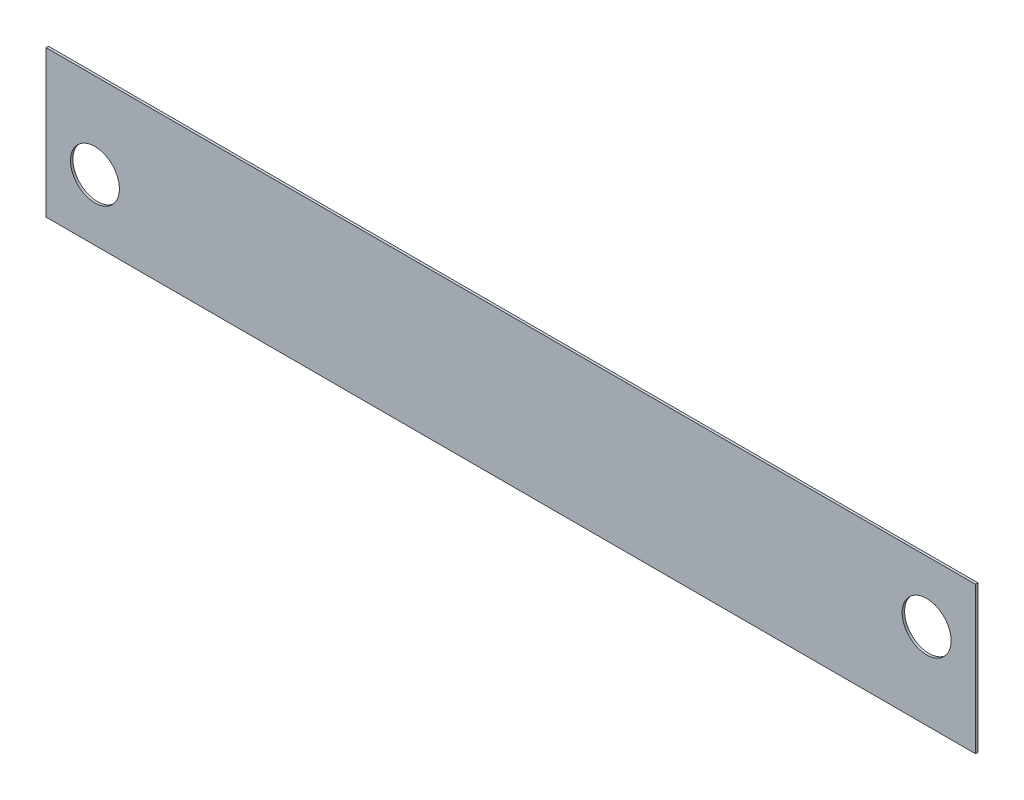
ISO-10303-21;
HEADER;
FILE_DESCRIPTION(('STEP AP214'),'2;1');
FILE_NAME('part.step','',(''),(''),'','','');
FILE_SCHEMA(('AUTOMOTIVE_DESIGN { 1 0 10303 214 1 1 1 1 }'));
ENDSEC;
DATA;
#1=APPLICATION_CONTEXT('core data for automotive mechanical design processes');
#2=APPLICATION_PROTOCOL_DEFINITION('international standard','automotive_design',2000,#1);
#3=PRODUCT_CONTEXT('',#1,'mechanical');
#4=PRODUCT('Part','Part','',(#3));
#5=PRODUCT_RELATED_PRODUCT_CATEGORY('part','',(#4));
#6=PRODUCT_DEFINITION_FORMATION('','',#4);
#7=PRODUCT_DEFINITION_CONTEXT('part definition',#1,'design');
#8=PRODUCT_DEFINITION('design','',#6,#7);
#9=PRODUCT_DEFINITION_SHAPE('','',#8);
#10=(LENGTH_UNIT() NAMED_UNIT(*) SI_UNIT(.MILLI.,.METRE.));
#11=(NAMED_UNIT(*) PLANE_ANGLE_UNIT() SI_UNIT($,.RADIAN.));
#12=(NAMED_UNIT(*) SI_UNIT($,.STERADIAN.) SOLID_ANGLE_UNIT());
#13=UNCERTAINTY_MEASURE_WITH_UNIT(LENGTH_MEASURE(1.E-05),#10,'distance_accuracy_value','');
#14=(GEOMETRIC_REPRESENTATION_CONTEXT(3) GLOBAL_UNCERTAINTY_ASSIGNED_CONTEXT((#13)) GLOBAL_UNIT_ASSIGNED_CONTEXT((#10,
#11,#12)) REPRESENTATION_CONTEXT('',''));
#15=CARTESIAN_POINT('',(0.,0.,0.));
#16=DIRECTION('',(0.,0.,1.));
#17=DIRECTION('',(1.,0.,0.));
#18=AXIS2_PLACEMENT_3D('',#15,#16,#17);
#19=CARTESIAN_POINT('',(-20.,35.,1.));
#20=DIRECTION('',(0.,0.,1.));
#21=DIRECTION('',(1.,0.,0.));
#22=AXIS2_PLACEMENT_3D('',#19,#20,#21);
#23=PLANE('',#22);
#24=CARTESIAN_POINT('',(0.,0.,1.));
#25=DIRECTION('',(0.,0.,1.));
#26=DIRECTION('',(1.,0.,0.));
#27=AXIS2_PLACEMENT_3D('',#24,#25,#26);
#28=CIRCLE('',#27,10.);
#29=CARTESIAN_POINT('',(10.,0.,1.));
#30=VERTEX_POINT('',#29);
#31=EDGE_CURVE('E100',#30,#30,#28,.T.);
#32=ORIENTED_EDGE('',*,*,#31,.F.);
#33=EDGE_LOOP('',(#32));
#34=FACE_BOUND('',#33,.T.);
#35=DIRECTION('',(0.,-1.,0.));
#36=VECTOR('',#35,1.);
#37=CARTESIAN_POINT('',(-20.,-25.,1.));
#38=LINE('',#37,#36);
#39=CARTESIAN_POINT('',(-20.,35.,1.));
#40=VERTEX_POINT('',#39);
#41=CARTESIAN_POINT('',(-20.,-25.,1.));
#42=VERTEX_POINT('',#41);
#43=EDGE_CURVE('E110',#40,#42,#38,.T.);
#44=ORIENTED_EDGE('',*,*,#43,.T.);
#45=DIRECTION('',(1.,0.,0.));
#46=VECTOR('',#45,1.);
#47=CARTESIAN_POINT('',(-20.,-25.,1.));
#48=LINE('',#47,#46);
#49=CARTESIAN_POINT('',(360.,-25.,1.));
#50=VERTEX_POINT('',#49);
#51=EDGE_CURVE('E95',#42,#50,#48,.T.);
#52=ORIENTED_EDGE('',*,*,#51,.T.);
#53=DIRECTION('',(0.,1.,0.));
#54=VECTOR('',#53,1.);
#55=CARTESIAN_POINT('',(360.,35.,1.));
#56=LINE('',#55,#54);
#57=CARTESIAN_POINT('',(360.,35.,1.));
#58=VERTEX_POINT('',#57);
#59=EDGE_CURVE('E61',#50,#58,#56,.T.);
#60=ORIENTED_EDGE('',*,*,#59,.T.);
#61=DIRECTION('',(-1.,0.,0.));
#62=VECTOR('',#61,1.);
#63=CARTESIAN_POINT('',(360.,35.,1.));
#64=LINE('',#63,#62);
#65=EDGE_CURVE('E56',#58,#40,#64,.T.);
#66=ORIENTED_EDGE('',*,*,#65,.T.);
#67=EDGE_LOOP('',(#44,#52,#60,#66));
#68=FACE_BOUND('',#67,.T.);
#69=CARTESIAN_POINT('',(340.,10.,1.));
#70=DIRECTION('',(0.,0.,1.));
#71=DIRECTION('',(1.,0.,0.));
#72=AXIS2_PLACEMENT_3D('',#69,#70,#71);
#73=CIRCLE('',#72,9.99999999999998);
#74=CARTESIAN_POINT('',(350.,10.,1.));
#75=VERTEX_POINT('',#74);
#76=EDGE_CURVE('E128',#75,#75,#73,.T.);
#77=ORIENTED_EDGE('',*,*,#76,.F.);
#78=EDGE_LOOP('',(#77));
#79=FACE_BOUND('',#78,.T.);
#80=ADVANCED_FACE('F41',(#34,#68,#79),#23,.T.);
#81=CARTESIAN_POINT('',(-20.,35.,0.));
#82=DIRECTION('',(0.,0.,1.));
#83=DIRECTION('',(1.,0.,0.));
#84=AXIS2_PLACEMENT_3D('',#81,#82,#83);
#85=PLANE('',#84);
#86=CARTESIAN_POINT('',(0.,0.,0.));
#87=DIRECTION('',(0.,0.,1.));
#88=DIRECTION('',(1.,0.,0.));
#89=AXIS2_PLACEMENT_3D('',#86,#87,#88);
#90=CIRCLE('',#89,10.);
#91=CARTESIAN_POINT('',(10.,0.,0.));
#92=VERTEX_POINT('',#91);
#93=EDGE_CURVE('E103',#92,#92,#90,.T.);
#94=ORIENTED_EDGE('',*,*,#93,.T.);
#95=EDGE_LOOP('',(#94));
#96=FACE_BOUND('',#95,.T.);
#97=DIRECTION('',(0.,-1.,0.));
#98=VECTOR('',#97,1.);
#99=CARTESIAN_POINT('',(-20.,-25.,0.));
#100=LINE('',#99,#98);
#101=CARTESIAN_POINT('',(-20.,35.,0.));
#102=VERTEX_POINT('',#101);
#103=CARTESIAN_POINT('',(-20.,-25.,0.));
#104=VERTEX_POINT('',#103);
#105=EDGE_CURVE('E87',#102,#104,#100,.T.);
#106=ORIENTED_EDGE('',*,*,#105,.F.);
#107=DIRECTION('',(-1.,0.,0.));
#108=VECTOR('',#107,1.);
#109=CARTESIAN_POINT('',(360.,35.,0.));
#110=LINE('',#109,#108);
#111=CARTESIAN_POINT('',(360.,35.,0.));
#112=VERTEX_POINT('',#111);
#113=EDGE_CURVE('E108',#112,#102,#110,.T.);
#114=ORIENTED_EDGE('',*,*,#113,.F.);
#115=DIRECTION('',(0.,1.,0.));
#116=VECTOR('',#115,1.);
#117=CARTESIAN_POINT('',(360.,35.,0.));
#118=LINE('',#117,#116);
#119=CARTESIAN_POINT('',(360.,-25.,0.));
#120=VERTEX_POINT('',#119);
#121=EDGE_CURVE('E88',#120,#112,#118,.T.);
#122=ORIENTED_EDGE('',*,*,#121,.F.);
#123=DIRECTION('',(1.,0.,0.));
#124=VECTOR('',#123,1.);
#125=CARTESIAN_POINT('',(-20.,-25.,0.));
#126=LINE('',#125,#124);
#127=EDGE_CURVE('E82',#104,#120,#126,.T.);
#128=ORIENTED_EDGE('',*,*,#127,.F.);
#129=EDGE_LOOP('',(#106,#114,#122,#128));
#130=FACE_BOUND('',#129,.T.);
#131=CARTESIAN_POINT('',(340.,10.,0.));
#132=DIRECTION('',(0.,0.,1.));
#133=DIRECTION('',(1.,0.,0.));
#134=AXIS2_PLACEMENT_3D('',#131,#132,#133);
#135=CIRCLE('',#134,9.99999999999998);
#136=CARTESIAN_POINT('',(350.,10.,0.));
#137=VERTEX_POINT('',#136);
#138=EDGE_CURVE('E130',#137,#137,#135,.T.);
#139=ORIENTED_EDGE('',*,*,#138,.T.);
#140=EDGE_LOOP('',(#139));
#141=FACE_BOUND('',#140,.T.);
#142=ADVANCED_FACE('F83',(#96,#130,#141),#85,.F.);
#143=CARTESIAN_POINT('',(-20.,-25.,1.));
#144=DIRECTION('',(1.,0.,0.));
#145=DIRECTION('',(0.,1.,0.));
#146=AXIS2_PLACEMENT_3D('',#143,#144,#145);
#147=PLANE('',#146);
#148=ORIENTED_EDGE('',*,*,#105,.T.);
#149=DIRECTION('',(0.,0.,-1.));
#150=VECTOR('',#149,1.);
#151=CARTESIAN_POINT('',(-20.,-25.,1.));
#152=LINE('',#151,#150);
#153=EDGE_CURVE('E11',#42,#104,#152,.T.);
#154=ORIENTED_EDGE('',*,*,#153,.F.);
#155=ORIENTED_EDGE('',*,*,#43,.F.);
#156=DIRECTION('',(0.,0.,-1.));
#157=VECTOR('',#156,1.);
#158=CARTESIAN_POINT('',(-20.,35.,1.));
#159=LINE('',#158,#157);
#160=EDGE_CURVE('E99',#40,#102,#159,.T.);
#161=ORIENTED_EDGE('',*,*,#160,.T.);
#162=EDGE_LOOP('',(#148,#154,#155,#161));
#163=FACE_BOUND('',#162,.T.);
#164=ADVANCED_FACE('F43',(#163),#147,.F.);
#165=CARTESIAN_POINT('',(-20.,-25.,1.));
#166=DIRECTION('',(0.,1.,0.));
#167=DIRECTION('',(0.,0.,1.));
#168=AXIS2_PLACEMENT_3D('',#165,#166,#167);
#169=PLANE('',#168);
#170=ORIENTED_EDGE('',*,*,#127,.T.);
#171=DIRECTION('',(0.,0.,-1.));
#172=VECTOR('',#171,1.);
#173=CARTESIAN_POINT('',(360.,-25.,1.));
#174=LINE('',#173,#172);
#175=EDGE_CURVE('E49',#50,#120,#174,.T.);
#176=ORIENTED_EDGE('',*,*,#175,.F.);
#177=ORIENTED_EDGE('',*,*,#51,.F.);
#178=ORIENTED_EDGE('',*,*,#153,.T.);
#179=EDGE_LOOP('',(#170,#176,#177,#178));
#180=FACE_BOUND('',#179,.T.);
#181=ADVANCED_FACE('F94',(#180),#169,.F.);
#182=CARTESIAN_POINT('',(360.,35.,1.));
#183=DIRECTION('',(-1.,0.,0.));
#184=DIRECTION('',(0.,0.,1.));
#185=AXIS2_PLACEMENT_3D('',#182,#183,#184);
#186=PLANE('',#185);
#187=ORIENTED_EDGE('',*,*,#121,.T.);
#188=DIRECTION('',(0.,0.,-1.));
#189=VECTOR('',#188,1.);
#190=CARTESIAN_POINT('',(360.,35.,1.));
#191=LINE('',#190,#189);
#192=EDGE_CURVE('E116',#58,#112,#191,.T.);
#193=ORIENTED_EDGE('',*,*,#192,.F.);
#194=ORIENTED_EDGE('',*,*,#59,.F.);
#195=ORIENTED_EDGE('',*,*,#175,.T.);
#196=EDGE_LOOP('',(#187,#193,#194,#195));
#197=FACE_BOUND('',#196,.T.);
#198=ADVANCED_FACE('F119',(#197),#186,.F.);
#199=CARTESIAN_POINT('',(360.,35.,1.));
#200=DIRECTION('',(0.,-1.,0.));
#201=DIRECTION('',(1.,0.,0.));
#202=AXIS2_PLACEMENT_3D('',#199,#200,#201);
#203=PLANE('',#202);
#204=ORIENTED_EDGE('',*,*,#113,.T.);
#205=ORIENTED_EDGE('',*,*,#160,.F.);
#206=ORIENTED_EDGE('',*,*,#65,.F.);
#207=ORIENTED_EDGE('',*,*,#192,.T.);
#208=EDGE_LOOP('',(#204,#205,#206,#207));
#209=FACE_BOUND('',#208,.T.);
#210=ADVANCED_FACE('F121',(#209),#203,.F.);
#211=CARTESIAN_POINT('',(0.,0.,1.));
#212=DIRECTION('',(0.,0.,-1.));
#213=DIRECTION('',(-1.,0.,0.));
#214=AXIS2_PLACEMENT_3D('',#211,#212,#213);
#215=CYLINDRICAL_SURFACE('',#214,10.);
#216=ORIENTED_EDGE('',*,*,#31,.T.);
#217=EDGE_LOOP('',(#216));
#218=FACE_BOUND('',#217,.T.);
#219=ORIENTED_EDGE('',*,*,#93,.F.);
#220=EDGE_LOOP('',(#219));
#221=FACE_BOUND('',#220,.T.);
#222=ADVANCED_FACE('F139',(#218,#221),#215,.F.);
#223=CARTESIAN_POINT('',(340.,10.,1.));
#224=DIRECTION('',(0.,0.,-1.));
#225=DIRECTION('',(-1.,0.,0.));
#226=AXIS2_PLACEMENT_3D('',#223,#224,#225);
#227=CYLINDRICAL_SURFACE('',#226,9.99999999999998);
#228=ORIENTED_EDGE('',*,*,#76,.T.);
#229=EDGE_LOOP('',(#228));
#230=FACE_BOUND('',#229,.T.);
#231=ORIENTED_EDGE('',*,*,#138,.F.);
#232=EDGE_LOOP('',(#231));
#233=FACE_BOUND('',#232,.T.);
#234=ADVANCED_FACE('F137',(#230,#233),#227,.F.);
#235=CLOSED_SHELL('',(#80,#142,#164,#181,#198,#210,#222,#234));
#236=MANIFOLD_SOLID_BREP('B2',#235);
#237=ADVANCED_BREP_SHAPE_REPRESENTATION('',(#18,#236),#14);
#238=SHAPE_DEFINITION_REPRESENTATION(#9,#237);
ENDSEC;
END-ISO-10303-21;
